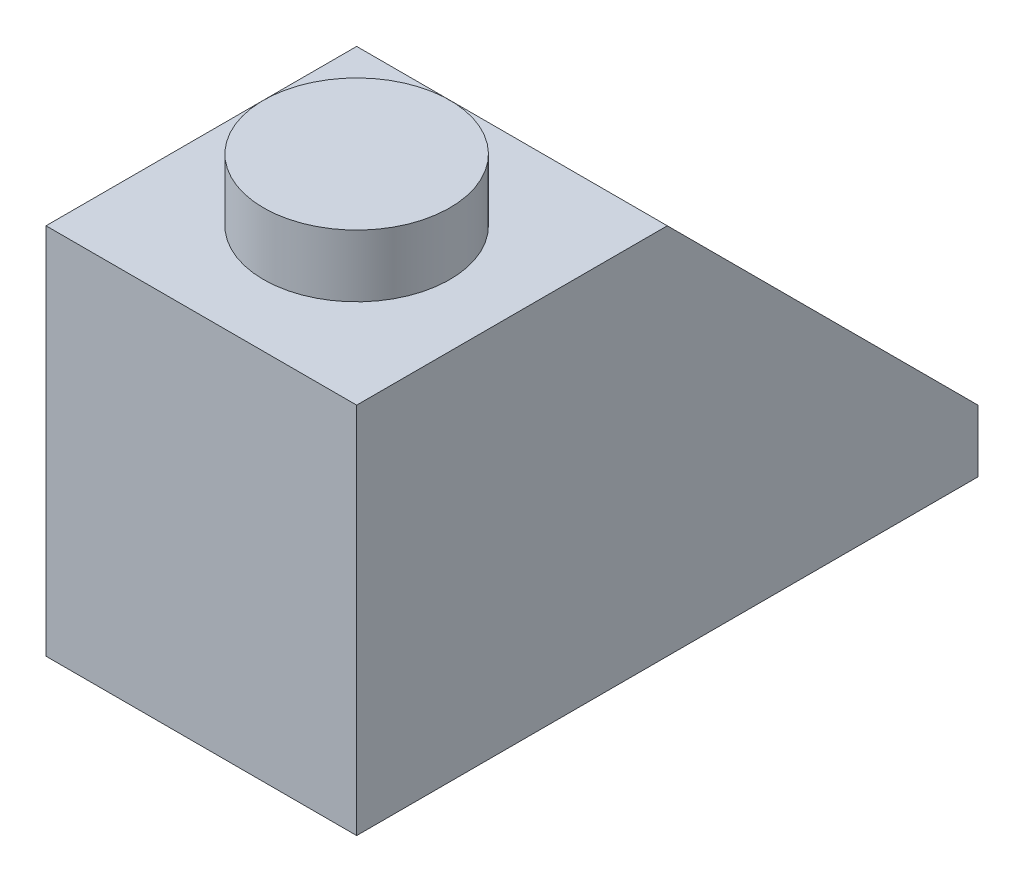
ISO-10303-21;
HEADER;
FILE_DESCRIPTION(('STEP AP214'),'2;1');
FILE_NAME('part.step','',(''),(''),'','','');
FILE_SCHEMA(('AUTOMOTIVE_DESIGN { 1 0 10303 214 1 1 1 1 }'));
ENDSEC;
DATA;
#1=APPLICATION_CONTEXT('core data for automotive mechanical design processes');
#2=APPLICATION_PROTOCOL_DEFINITION('international standard','automotive_design',2000,#1);
#3=PRODUCT_CONTEXT('',#1,'mechanical');
#4=PRODUCT('Part','Part','',(#3));
#5=PRODUCT_RELATED_PRODUCT_CATEGORY('part','',(#4));
#6=PRODUCT_DEFINITION_FORMATION('','',#4);
#7=PRODUCT_DEFINITION_CONTEXT('part definition',#1,'design');
#8=PRODUCT_DEFINITION('design','',#6,#7);
#9=PRODUCT_DEFINITION_SHAPE('','',#8);
#10=(LENGTH_UNIT() NAMED_UNIT(*) SI_UNIT(.MILLI.,.METRE.));
#11=(NAMED_UNIT(*) PLANE_ANGLE_UNIT() SI_UNIT($,.RADIAN.));
#12=(NAMED_UNIT(*) SI_UNIT($,.STERADIAN.) SOLID_ANGLE_UNIT());
#13=UNCERTAINTY_MEASURE_WITH_UNIT(LENGTH_MEASURE(1.E-05),#10,'distance_accuracy_value','');
#14=(GEOMETRIC_REPRESENTATION_CONTEXT(3) GLOBAL_UNCERTAINTY_ASSIGNED_CONTEXT((#13)) GLOBAL_UNIT_ASSIGNED_CONTEXT((#10,
#11,#12)) REPRESENTATION_CONTEXT('',''));
#15=CARTESIAN_POINT('',(0.,0.,0.));
#16=DIRECTION('',(0.,0.,1.));
#17=DIRECTION('',(1.,0.,0.));
#18=AXIS2_PLACEMENT_3D('',#15,#16,#17);
#19=CARTESIAN_POINT('',(5.,0.,0.));
#20=DIRECTION('',(0.,1.,0.));
#21=DIRECTION('',(0.,0.,1.));
#22=AXIS2_PLACEMENT_3D('',#19,#20,#21);
#23=PLANE('',#22);
#24=DIRECTION('',(0.,0.,-1.));
#25=VECTOR('',#24,1.);
#26=CARTESIAN_POINT('',(0.,0.,0.));
#27=LINE('',#26,#25);
#28=CARTESIAN_POINT('',(0.,0.,0.));
#29=VERTEX_POINT('',#28);
#30=CARTESIAN_POINT('',(0.,0.,-10.));
#31=VERTEX_POINT('',#30);
#32=EDGE_CURVE('E159',#29,#31,#27,.T.);
#33=ORIENTED_EDGE('',*,*,#32,.T.);
#34=DIRECTION('',(-1.,0.,0.));
#35=VECTOR('',#34,1.);
#36=CARTESIAN_POINT('',(5.,0.,-10.));
#37=LINE('',#36,#35);
#38=CARTESIAN_POINT('',(5.,0.,-10.));
#39=VERTEX_POINT('',#38);
#40=EDGE_CURVE('E40',#39,#31,#37,.T.);
#41=ORIENTED_EDGE('',*,*,#40,.F.);
#42=DIRECTION('',(0.,0.,-1.));
#43=VECTOR('',#42,1.);
#44=CARTESIAN_POINT('',(5.,0.,0.));
#45=LINE('',#44,#43);
#46=CARTESIAN_POINT('',(5.,0.,0.));
#47=VERTEX_POINT('',#46);
#48=EDGE_CURVE('E179',#47,#39,#45,.T.);
#49=ORIENTED_EDGE('',*,*,#48,.F.);
#50=DIRECTION('',(-1.,0.,0.));
#51=VECTOR('',#50,1.);
#52=CARTESIAN_POINT('',(5.,0.,0.));
#53=LINE('',#52,#51);
#54=EDGE_CURVE('E194',#47,#29,#53,.T.);
#55=ORIENTED_EDGE('',*,*,#54,.T.);
#56=EDGE_LOOP('',(#33,#41,#49,#55));
#57=FACE_BOUND('',#56,.T.);
#58=DIRECTION('',(-1.,0.,0.));
#59=VECTOR('',#58,1.);
#60=CARTESIAN_POINT('',(4.,0.,-1.));
#61=LINE('',#60,#59);
#62=CARTESIAN_POINT('',(4.,0.,-1.));
#63=VERTEX_POINT('',#62);
#64=CARTESIAN_POINT('',(1.,0.,-1.));
#65=VERTEX_POINT('',#64);
#66=EDGE_CURVE('E165',#63,#65,#61,.T.);
#67=ORIENTED_EDGE('',*,*,#66,.F.);
#68=DIRECTION('',(0.,0.,-1.));
#69=VECTOR('',#68,1.);
#70=CARTESIAN_POINT('',(4.,0.,0.));
#71=LINE('',#70,#69);
#72=CARTESIAN_POINT('',(4.,0.,-9.));
#73=VERTEX_POINT('',#72);
#74=EDGE_CURVE('E168',#63,#73,#71,.T.);
#75=ORIENTED_EDGE('',*,*,#74,.T.);
#76=DIRECTION('',(-1.,0.,0.));
#77=VECTOR('',#76,1.);
#78=CARTESIAN_POINT('',(4.,0.,-9.));
#79=LINE('',#78,#77);
#80=CARTESIAN_POINT('',(1.,0.,-9.));
#81=VERTEX_POINT('',#80);
#82=EDGE_CURVE('E172',#73,#81,#79,.T.);
#83=ORIENTED_EDGE('',*,*,#82,.T.);
#84=DIRECTION('',(0.,0.,-1.));
#85=VECTOR('',#84,1.);
#86=CARTESIAN_POINT('',(1.,0.,0.));
#87=LINE('',#86,#85);
#88=EDGE_CURVE('E169',#65,#81,#87,.T.);
#89=ORIENTED_EDGE('',*,*,#88,.F.);
#90=EDGE_LOOP('',(#67,#75,#83,#89));
#91=FACE_BOUND('',#90,.T.);
#92=ADVANCED_FACE('F33',(#57,#91),#23,.F.);
#93=CARTESIAN_POINT('',(0.,0.,0.));
#94=DIRECTION('',(1.,0.,0.));
#95=DIRECTION('',(0.,0.,-1.));
#96=AXIS2_PLACEMENT_3D('',#93,#94,#95);
#97=PLANE('',#96);
#98=DIRECTION('',(0.,1.,0.));
#99=VECTOR('',#98,1.);
#100=CARTESIAN_POINT('',(0.,0.,-10.));
#101=LINE('',#100,#99);
#102=CARTESIAN_POINT('',(0.,1.,-10.));
#103=VERTEX_POINT('',#102);
#104=EDGE_CURVE('E196',#31,#103,#101,.T.);
#105=ORIENTED_EDGE('',*,*,#104,.F.);
#106=ORIENTED_EDGE('',*,*,#32,.F.);
#107=DIRECTION('',(0.,1.,0.));
#108=VECTOR('',#107,1.);
#109=CARTESIAN_POINT('',(0.,0.,0.));
#110=LINE('',#109,#108);
#111=CARTESIAN_POINT('',(0.,6.,0.));
#112=VERTEX_POINT('',#111);
#113=EDGE_CURVE('E183',#29,#112,#110,.T.);
#114=ORIENTED_EDGE('',*,*,#113,.T.);
#115=DIRECTION('',(0.,0.,-1.));
#116=VECTOR('',#115,1.);
#117=CARTESIAN_POINT('',(0.,6.,0.));
#118=LINE('',#117,#116);
#119=CARTESIAN_POINT('',(0.,6.,-5.));
#120=VERTEX_POINT('',#119);
#121=EDGE_CURVE('E202',#112,#120,#118,.T.);
#122=ORIENTED_EDGE('',*,*,#121,.T.);
#123=DIRECTION('',(0.,-0.707106781186548,-0.707106781186548));
#124=VECTOR('',#123,1.);
#125=CARTESIAN_POINT('',(0.,5.5,-5.5));
#126=LINE('',#125,#124);
#127=EDGE_CURVE('E199',#120,#103,#126,.T.);
#128=ORIENTED_EDGE('',*,*,#127,.T.);
#129=EDGE_LOOP('',(#105,#106,#114,#122,#128));
#130=FACE_BOUND('',#129,.T.);
#131=ADVANCED_FACE('F148',(#130),#97,.F.);
#132=CARTESIAN_POINT('',(5.,0.,-10.));
#133=DIRECTION('',(0.,0.,1.));
#134=DIRECTION('',(1.,0.,0.));
#135=AXIS2_PLACEMENT_3D('',#132,#133,#134);
#136=PLANE('',#135);
#137=ORIENTED_EDGE('',*,*,#104,.T.);
#138=DIRECTION('',(-1.,0.,0.));
#139=VECTOR('',#138,1.);
#140=CARTESIAN_POINT('',(5.,1.,-10.));
#141=LINE('',#140,#139);
#142=CARTESIAN_POINT('',(5.,1.,-10.));
#143=VERTEX_POINT('',#142);
#144=EDGE_CURVE('E212',#143,#103,#141,.T.);
#145=ORIENTED_EDGE('',*,*,#144,.F.);
#146=DIRECTION('',(0.,1.,0.));
#147=VECTOR('',#146,1.);
#148=CARTESIAN_POINT('',(5.,0.,-10.));
#149=LINE('',#148,#147);
#150=EDGE_CURVE('E182',#39,#143,#149,.T.);
#151=ORIENTED_EDGE('',*,*,#150,.F.);
#152=ORIENTED_EDGE('',*,*,#40,.T.);
#153=EDGE_LOOP('',(#137,#145,#151,#152));
#154=FACE_BOUND('',#153,.T.);
#155=ADVANCED_FACE('F153',(#154),#136,.F.);
#156=CARTESIAN_POINT('',(5.,5.5,-5.5));
#157=DIRECTION('',(0.,0.707106781186548,-0.707106781186548));
#158=DIRECTION('',(0.,0.707106781186548,0.707106781186548));
#159=AXIS2_PLACEMENT_3D('',#156,#157,#158);
#160=PLANE('',#159);
#161=CARTESIAN_POINT('',(2.5,5.,-6.));
#162=VERTEX_POINT('',#161);
#163=VERTEX_LOOP('',#162);
#164=FACE_BOUND('',#163,.T.);
#165=ORIENTED_EDGE('',*,*,#127,.F.);
#166=DIRECTION('',(-1.,0.,0.));
#167=VECTOR('',#166,1.);
#168=CARTESIAN_POINT('',(5.,6.,-5.));
#169=LINE('',#168,#167);
#170=CARTESIAN_POINT('',(5.,6.,-5.));
#171=VERTEX_POINT('',#170);
#172=EDGE_CURVE('E210',#171,#120,#169,.T.);
#173=ORIENTED_EDGE('',*,*,#172,.F.);
#174=DIRECTION('',(0.,-0.707106781186548,-0.707106781186548));
#175=VECTOR('',#174,1.);
#176=CARTESIAN_POINT('',(5.,5.5,-5.5));
#177=LINE('',#176,#175);
#178=EDGE_CURVE('E185',#171,#143,#177,.T.);
#179=ORIENTED_EDGE('',*,*,#178,.T.);
#180=ORIENTED_EDGE('',*,*,#144,.T.);
#181=EDGE_LOOP('',(#165,#173,#179,#180));
#182=FACE_BOUND('',#181,.T.);
#183=ADVANCED_FACE('F228',(#164,#182),#160,.T.);
#184=CARTESIAN_POINT('',(5.,6.,0.));
#185=DIRECTION('',(0.,1.,0.));
#186=DIRECTION('',(0.,0.,1.));
#187=AXIS2_PLACEMENT_3D('',#184,#185,#186);
#188=PLANE('',#187);
#189=CARTESIAN_POINT('',(2.5,6.,-2.5));
#190=DIRECTION('',(0.,1.,0.));
#191=DIRECTION('',(0.,0.,1.));
#192=AXIS2_PLACEMENT_3D('',#189,#190,#191);
#193=CIRCLE('',#192,1.5);
#194=CARTESIAN_POINT('',(2.5,6.,-1.));
#195=VERTEX_POINT('',#194);
#196=EDGE_CURVE('E128',#195,#195,#193,.T.);
#197=ORIENTED_EDGE('',*,*,#196,.F.);
#198=EDGE_LOOP('',(#197));
#199=FACE_BOUND('',#198,.T.);
#200=ORIENTED_EDGE('',*,*,#121,.F.);
#201=DIRECTION('',(-1.,0.,0.));
#202=VECTOR('',#201,1.);
#203=CARTESIAN_POINT('',(5.,6.,0.));
#204=LINE('',#203,#202);
#205=CARTESIAN_POINT('',(5.,6.,0.));
#206=VERTEX_POINT('',#205);
#207=EDGE_CURVE('E208',#206,#112,#204,.T.);
#208=ORIENTED_EDGE('',*,*,#207,.F.);
#209=DIRECTION('',(0.,0.,-1.));
#210=VECTOR('',#209,1.);
#211=CARTESIAN_POINT('',(5.,6.,0.));
#212=LINE('',#211,#210);
#213=EDGE_CURVE('E188',#206,#171,#212,.T.);
#214=ORIENTED_EDGE('',*,*,#213,.T.);
#215=ORIENTED_EDGE('',*,*,#172,.T.);
#216=EDGE_LOOP('',(#200,#208,#214,#215));
#217=FACE_BOUND('',#216,.T.);
#218=ADVANCED_FACE('F230',(#199,#217),#188,.T.);
#219=CARTESIAN_POINT('',(5.,0.,0.));
#220=DIRECTION('',(0.,0.,1.));
#221=DIRECTION('',(1.,0.,0.));
#222=AXIS2_PLACEMENT_3D('',#219,#220,#221);
#223=PLANE('',#222);
#224=ORIENTED_EDGE('',*,*,#113,.F.);
#225=ORIENTED_EDGE('',*,*,#54,.F.);
#226=DIRECTION('',(0.,1.,0.));
#227=VECTOR('',#226,1.);
#228=CARTESIAN_POINT('',(5.,0.,0.));
#229=LINE('',#228,#227);
#230=EDGE_CURVE('E191',#47,#206,#229,.T.);
#231=ORIENTED_EDGE('',*,*,#230,.T.);
#232=ORIENTED_EDGE('',*,*,#207,.T.);
#233=EDGE_LOOP('',(#224,#225,#231,#232));
#234=FACE_BOUND('',#233,.T.);
#235=ADVANCED_FACE('F224',(#234),#223,.T.);
#236=CARTESIAN_POINT('',(5.,0.,0.));
#237=DIRECTION('',(1.,0.,0.));
#238=DIRECTION('',(0.,0.,-1.));
#239=AXIS2_PLACEMENT_3D('',#236,#237,#238);
#240=PLANE('',#239);
#241=ORIENTED_EDGE('',*,*,#48,.T.);
#242=ORIENTED_EDGE('',*,*,#150,.T.);
#243=ORIENTED_EDGE('',*,*,#178,.F.);
#244=ORIENTED_EDGE('',*,*,#213,.F.);
#245=ORIENTED_EDGE('',*,*,#230,.F.);
#246=EDGE_LOOP('',(#241,#242,#243,#244,#245));
#247=FACE_BOUND('',#246,.T.);
#248=ADVANCED_FACE('F220',(#247),#240,.T.);
#249=CARTESIAN_POINT('',(4.,5.,-5.));
#250=DIRECTION('',(0.,0.707106781186547,-0.707106781186547));
#251=DIRECTION('',(0.,0.707106781186548,0.707106781186548));
#252=AXIS2_PLACEMENT_3D('',#249,#250,#251);
#253=PLANE('',#252);
#254=CARTESIAN_POINT('',(2.5,5.,-5.));
#255=DIRECTION('',(0.,0.707106781186547,-0.707106781186547));
#256=DIRECTION('',(0.,0.707106781186548,0.707106781186548));
#257=AXIS2_PLACEMENT_3D('',#254,#255,#256);
#258=ELLIPSE('',#257,1.4142135623731,1.);
#259=CARTESIAN_POINT('',(1.5,5.,-5.));
#260=VERTEX_POINT('',#259);
#261=CARTESIAN_POINT('',(3.5,5.,-5.));
#262=VERTEX_POINT('',#261);
#263=EDGE_CURVE('E124',#260,#262,#258,.F.);
#264=ORIENTED_EDGE('',*,*,#263,.F.);
#265=DIRECTION('',(-1.,0.,0.));
#266=VECTOR('',#265,1.);
#267=CARTESIAN_POINT('',(4.,5.,-5.));
#268=LINE('',#267,#266);
#269=CARTESIAN_POINT('',(1.,5.,-5.));
#270=VERTEX_POINT('',#269);
#271=EDGE_CURVE('E111',#260,#270,#268,.T.);
#272=ORIENTED_EDGE('',*,*,#271,.T.);
#273=DIRECTION('',(0.,-0.707106781186548,-0.707106781186548));
#274=VECTOR('',#273,1.);
#275=CARTESIAN_POINT('',(1.,5.,-5.));
#276=LINE('',#275,#274);
#277=CARTESIAN_POINT('',(1.,1.,-9.));
#278=VERTEX_POINT('',#277);
#279=EDGE_CURVE('E422',#270,#278,#276,.T.);
#280=ORIENTED_EDGE('',*,*,#279,.T.);
#281=DIRECTION('',(-1.,0.,0.));
#282=VECTOR('',#281,1.);
#283=CARTESIAN_POINT('',(4.,1.,-9.));
#284=LINE('',#283,#282);
#285=CARTESIAN_POINT('',(4.,1.,-9.));
#286=VERTEX_POINT('',#285);
#287=EDGE_CURVE('E175',#286,#278,#284,.T.);
#288=ORIENTED_EDGE('',*,*,#287,.F.);
#289=DIRECTION('',(0.,-0.707106781186548,-0.707106781186548));
#290=VECTOR('',#289,1.);
#291=CARTESIAN_POINT('',(4.,5.,-5.));
#292=LINE('',#291,#290);
#293=CARTESIAN_POINT('',(4.,5.,-5.));
#294=VERTEX_POINT('',#293);
#295=EDGE_CURVE('E409',#294,#286,#292,.T.);
#296=ORIENTED_EDGE('',*,*,#295,.F.);
#297=EDGE_CURVE('E120',#294,#262,#268,.T.);
#298=ORIENTED_EDGE('',*,*,#297,.T.);
#299=EDGE_LOOP('',(#264,#272,#280,#288,#296,#298));
#300=FACE_BOUND('',#299,.T.);
#301=ADVANCED_FACE('F125',(#300),#253,.F.);
#302=CARTESIAN_POINT('',(4.,5.,0.));
#303=DIRECTION('',(0.,1.,0.));
#304=DIRECTION('',(0.,0.,1.));
#305=AXIS2_PLACEMENT_3D('',#302,#303,#304);
#306=PLANE('',#305);
#307=CARTESIAN_POINT('',(2.5,5.,-5.));
#308=DIRECTION('',(0.,1.,0.));
#309=DIRECTION('',(0.,0.,1.));
#310=AXIS2_PLACEMENT_3D('',#307,#308,#309);
#311=CIRCLE('',#310,1.);
#312=EDGE_CURVE('E11',#262,#260,#311,.F.);
#313=ORIENTED_EDGE('',*,*,#312,.F.);
#314=ORIENTED_EDGE('',*,*,#297,.F.);
#315=DIRECTION('',(0.,0.,-1.));
#316=VECTOR('',#315,1.);
#317=CARTESIAN_POINT('',(4.,5.,0.));
#318=LINE('',#317,#316);
#319=CARTESIAN_POINT('',(4.,5.,-0.999999999999999));
#320=VERTEX_POINT('',#319);
#321=EDGE_CURVE('E406',#320,#294,#318,.T.);
#322=ORIENTED_EDGE('',*,*,#321,.F.);
#323=DIRECTION('',(-1.,0.,0.));
#324=VECTOR('',#323,1.);
#325=CARTESIAN_POINT('',(4.,5.,-0.999999999999999));
#326=LINE('',#325,#324);
#327=CARTESIAN_POINT('',(1.,5.,-0.999999999999999));
#328=VERTEX_POINT('',#327);
#329=EDGE_CURVE('E121',#320,#328,#326,.T.);
#330=ORIENTED_EDGE('',*,*,#329,.T.);
#331=DIRECTION('',(0.,0.,-1.));
#332=VECTOR('',#331,1.);
#333=CARTESIAN_POINT('',(1.,5.,0.));
#334=LINE('',#333,#332);
#335=EDGE_CURVE('E116',#328,#270,#334,.T.);
#336=ORIENTED_EDGE('',*,*,#335,.T.);
#337=ORIENTED_EDGE('',*,*,#271,.F.);
#338=EDGE_LOOP('',(#313,#314,#322,#330,#336,#337));
#339=FACE_BOUND('',#338,.T.);
#340=CARTESIAN_POINT('',(2.5,5.,-2.5));
#341=DIRECTION('',(0.,1.,0.));
#342=DIRECTION('',(0.,0.,1.));
#343=AXIS2_PLACEMENT_3D('',#340,#341,#342);
#344=CIRCLE('',#343,0.75);
#345=CARTESIAN_POINT('',(2.5,5.,-1.75));
#346=VERTEX_POINT('',#345);
#347=EDGE_CURVE('E423',#346,#346,#344,.F.);
#348=ORIENTED_EDGE('',*,*,#347,.F.);
#349=EDGE_LOOP('',(#348));
#350=FACE_BOUND('',#349,.T.);
#351=ADVANCED_FACE('F113',(#339,#350),#306,.F.);
#352=CARTESIAN_POINT('',(4.,0.,-1.));
#353=DIRECTION('',(0.,0.,-1.));
#354=DIRECTION('',(0.,1.,0.));
#355=AXIS2_PLACEMENT_3D('',#352,#353,#354);
#356=PLANE('',#355);
#357=DIRECTION('',(0.,-1.,0.));
#358=VECTOR('',#357,1.);
#359=CARTESIAN_POINT('',(1.,0.,-1.));
#360=LINE('',#359,#358);
#361=EDGE_CURVE('E401',#328,#65,#360,.T.);
#362=ORIENTED_EDGE('',*,*,#361,.F.);
#363=ORIENTED_EDGE('',*,*,#329,.F.);
#364=DIRECTION('',(0.,-1.,0.));
#365=VECTOR('',#364,1.);
#366=CARTESIAN_POINT('',(4.,0.,-1.));
#367=LINE('',#366,#365);
#368=EDGE_CURVE('E408',#320,#63,#367,.T.);
#369=ORIENTED_EDGE('',*,*,#368,.T.);
#370=ORIENTED_EDGE('',*,*,#66,.T.);
#371=EDGE_LOOP('',(#362,#363,#369,#370));
#372=FACE_BOUND('',#371,.T.);
#373=ADVANCED_FACE('F274',(#372),#356,.T.);
#374=CARTESIAN_POINT('',(4.,0.,-9.));
#375=DIRECTION('',(0.,0.,1.));
#376=DIRECTION('',(1.,0.,0.));
#377=AXIS2_PLACEMENT_3D('',#374,#375,#376);
#378=PLANE('',#377);
#379=DIRECTION('',(0.,1.,0.));
#380=VECTOR('',#379,1.);
#381=CARTESIAN_POINT('',(1.,0.,-9.));
#382=LINE('',#381,#380);
#383=EDGE_CURVE('E412',#81,#278,#382,.T.);
#384=ORIENTED_EDGE('',*,*,#383,.F.);
#385=ORIENTED_EDGE('',*,*,#82,.F.);
#386=DIRECTION('',(0.,1.,0.));
#387=VECTOR('',#386,1.);
#388=CARTESIAN_POINT('',(4.,0.,-9.));
#389=LINE('',#388,#387);
#390=EDGE_CURVE('E417',#73,#286,#389,.T.);
#391=ORIENTED_EDGE('',*,*,#390,.T.);
#392=ORIENTED_EDGE('',*,*,#287,.T.);
#393=EDGE_LOOP('',(#384,#385,#391,#392));
#394=FACE_BOUND('',#393,.T.);
#395=ADVANCED_FACE('F350',(#394),#378,.T.);
#396=CARTESIAN_POINT('',(4.,0.,0.));
#397=DIRECTION('',(1.,0.,0.));
#398=DIRECTION('',(0.,0.,-1.));
#399=AXIS2_PLACEMENT_3D('',#396,#397,#398);
#400=PLANE('',#399);
#401=ORIENTED_EDGE('',*,*,#295,.T.);
#402=ORIENTED_EDGE('',*,*,#390,.F.);
#403=ORIENTED_EDGE('',*,*,#74,.F.);
#404=ORIENTED_EDGE('',*,*,#368,.F.);
#405=ORIENTED_EDGE('',*,*,#321,.T.);
#406=EDGE_LOOP('',(#401,#402,#403,#404,#405));
#407=FACE_BOUND('',#406,.T.);
#408=ADVANCED_FACE('F325',(#407),#400,.F.);
#409=CARTESIAN_POINT('',(1.,0.,0.));
#410=DIRECTION('',(1.,0.,0.));
#411=DIRECTION('',(0.,0.,-1.));
#412=AXIS2_PLACEMENT_3D('',#409,#410,#411);
#413=PLANE('',#412);
#414=ORIENTED_EDGE('',*,*,#279,.F.);
#415=ORIENTED_EDGE('',*,*,#335,.F.);
#416=ORIENTED_EDGE('',*,*,#361,.T.);
#417=ORIENTED_EDGE('',*,*,#88,.T.);
#418=ORIENTED_EDGE('',*,*,#383,.T.);
#419=EDGE_LOOP('',(#414,#415,#416,#417,#418));
#420=FACE_BOUND('',#419,.T.);
#421=ADVANCED_FACE('F316',(#420),#413,.T.);
#422=CARTESIAN_POINT('',(2.5,-0.00100000000000013,-2.5));
#423=DIRECTION('',(0.,1.,0.));
#424=DIRECTION('',(0.,0.,1.));
#425=AXIS2_PLACEMENT_3D('',#422,#423,#424);
#426=CYLINDRICAL_SURFACE('',#425,0.75);
#427=CARTESIAN_POINT('',(2.5,6.,-2.5));
#428=DIRECTION('',(0.,1.,0.));
#429=DIRECTION('',(0.,0.,1.));
#430=AXIS2_PLACEMENT_3D('',#427,#428,#429);
#431=CIRCLE('',#430,0.75);
#432=CARTESIAN_POINT('',(2.5,6.,-1.75));
#433=VERTEX_POINT('',#432);
#434=EDGE_CURVE('E427',#433,#433,#431,.F.);
#435=CARTESIAN_POINT('',(2.5,6.,-1.75));
#436=CARTESIAN_POINT('',(2.5,5.98958333333333,-1.75));
#437=CARTESIAN_POINT('',(2.5,5.97916666666667,-1.75));
#438=CARTESIAN_POINT('',(2.5,5.95833333333333,-1.75));
#439=CARTESIAN_POINT('',(2.5,5.94791666666667,-1.75));
#440=CARTESIAN_POINT('',(2.5,5.92708333333333,-1.75));
#441=CARTESIAN_POINT('',(2.5,5.91666666666667,-1.75));
#442=CARTESIAN_POINT('',(2.5,5.89583333333333,-1.75));
#443=CARTESIAN_POINT('',(2.5,5.88541666666667,-1.75));
#444=CARTESIAN_POINT('',(2.5,5.86458333333333,-1.75));
#445=CARTESIAN_POINT('',(2.5,5.85416666666667,-1.75));
#446=CARTESIAN_POINT('',(2.5,5.83333333333333,-1.75));
#447=CARTESIAN_POINT('',(2.5,5.82291666666667,-1.75));
#448=CARTESIAN_POINT('',(2.5,5.80208333333333,-1.75));
#449=CARTESIAN_POINT('',(2.5,5.79166666666667,-1.75));
#450=CARTESIAN_POINT('',(2.5,5.77083333333333,-1.75));
#451=CARTESIAN_POINT('',(2.5,5.76041666666667,-1.75));
#452=CARTESIAN_POINT('',(2.5,5.73958333333333,-1.75));
#453=CARTESIAN_POINT('',(2.5,5.72916666666667,-1.75));
#454=CARTESIAN_POINT('',(2.5,5.70833333333333,-1.75));
#455=CARTESIAN_POINT('',(2.5,5.69791666666667,-1.75));
#456=CARTESIAN_POINT('',(2.5,5.67708333333333,-1.75));
#457=CARTESIAN_POINT('',(2.5,5.66666666666667,-1.75));
#458=CARTESIAN_POINT('',(2.5,5.64583333333333,-1.75));
#459=CARTESIAN_POINT('',(2.5,5.63541666666667,-1.75));
#460=CARTESIAN_POINT('',(2.5,5.61458333333333,-1.75));
#461=CARTESIAN_POINT('',(2.5,5.60416666666667,-1.75));
#462=CARTESIAN_POINT('',(2.5,5.58333333333333,-1.75));
#463=CARTESIAN_POINT('',(2.5,5.57291666666667,-1.75));
#464=CARTESIAN_POINT('',(2.5,5.55208333333333,-1.75));
#465=CARTESIAN_POINT('',(2.5,5.54166666666667,-1.75));
#466=CARTESIAN_POINT('',(2.5,5.52083333333333,-1.75));
#467=CARTESIAN_POINT('',(2.5,5.51041666666667,-1.75));
#468=CARTESIAN_POINT('',(2.5,5.48958333333333,-1.75));
#469=CARTESIAN_POINT('',(2.5,5.47916666666667,-1.75));
#470=CARTESIAN_POINT('',(2.5,5.45833333333333,-1.75));
#471=CARTESIAN_POINT('',(2.5,5.44791666666667,-1.75));
#472=CARTESIAN_POINT('',(2.5,5.42708333333333,-1.75));
#473=CARTESIAN_POINT('',(2.5,5.41666666666667,-1.75));
#474=CARTESIAN_POINT('',(2.5,5.39583333333333,-1.75));
#475=CARTESIAN_POINT('',(2.5,5.38541666666667,-1.75));
#476=CARTESIAN_POINT('',(2.5,5.36458333333333,-1.75));
#477=CARTESIAN_POINT('',(2.5,5.35416666666667,-1.75));
#478=CARTESIAN_POINT('',(2.5,5.33333333333333,-1.75));
#479=CARTESIAN_POINT('',(2.5,5.32291666666667,-1.75));
#480=CARTESIAN_POINT('',(2.5,5.30208333333333,-1.75));
#481=CARTESIAN_POINT('',(2.5,5.29166666666667,-1.75));
#482=CARTESIAN_POINT('',(2.5,5.27083333333333,-1.75));
#483=CARTESIAN_POINT('',(2.5,5.26041666666667,-1.75));
#484=CARTESIAN_POINT('',(2.5,5.23958333333333,-1.75));
#485=CARTESIAN_POINT('',(2.5,5.22916666666667,-1.75));
#486=CARTESIAN_POINT('',(2.5,5.20833333333333,-1.75));
#487=CARTESIAN_POINT('',(2.5,5.19791666666667,-1.75));
#488=CARTESIAN_POINT('',(2.5,5.17708333333333,-1.75));
#489=CARTESIAN_POINT('',(2.5,5.16666666666667,-1.75));
#490=CARTESIAN_POINT('',(2.5,5.14583333333333,-1.75));
#491=CARTESIAN_POINT('',(2.5,5.13541666666667,-1.75));
#492=CARTESIAN_POINT('',(2.5,5.11458333333333,-1.75));
#493=CARTESIAN_POINT('',(2.5,5.10416666666667,-1.75));
#494=CARTESIAN_POINT('',(2.5,5.08333333333333,-1.75));
#495=CARTESIAN_POINT('',(2.5,5.07291666666667,-1.75));
#496=CARTESIAN_POINT('',(2.5,5.05208333333333,-1.75));
#497=CARTESIAN_POINT('',(2.5,5.04166666666667,-1.75));
#498=CARTESIAN_POINT('',(2.5,5.02083333333333,-1.75));
#499=CARTESIAN_POINT('',(2.5,5.01041666666667,-1.75));
#500=CARTESIAN_POINT('',(2.5,5.,-1.75));
#501=B_SPLINE_CURVE_WITH_KNOTS('',3,(#435,#436,#437,#438,#439,#440,#441,#442,#443,#444,#445,
#446,#447,#448,#449,#450,#451,#452,#453,#454,#455,#456,#457,#458,#459,#460,#461,#462,#463,#464,
#465,#466,#467,#468,#469,#470,#471,#472,#473,#474,#475,#476,#477,#478,#479,#480,#481,#482,#483,
#484,#485,#486,#487,#488,#489,#490,#491,#492,#493,#494,#495,#496,#497,#498,#499,#500),
.UNSPECIFIED.,.F.,.F.,(4,2,2,2,2,2,2,2,2,2,2,2,2,2,2,2,2,2,2,2,2,2,2,2,2,2,2,2,2,2,2,2,4),(0.,
0.03125,0.0625000000000001,0.0937500000000001,0.125,0.15625,0.1875,0.21875,0.25,0.28125,0.3125,
0.34375,0.375,0.40625,0.4375,0.46875,0.5,0.53125,0.5625,0.593750000000001,0.625000000000001,
0.656250000000001,0.687500000000001,0.718750000000001,0.750000000000001,0.781250000000001,
0.812500000000001,0.843750000000001,0.875000000000001,0.906250000000001,0.937500000000001,
0.968750000000001,1.),.UNSPECIFIED.);
#502=EDGE_CURVE('BSEAM307',#433,#346,#501,.T.);
#503=ORIENTED_EDGE('',*,*,#434,.F.);
#504=ORIENTED_EDGE('',*,*,#347,.T.);
#505=ORIENTED_EDGE('',*,*,#502,.T.);
#506=ORIENTED_EDGE('',*,*,#502,.F.);
#507=EDGE_LOOP('',(#503,#505,#504,#506));
#508=FACE_BOUND('',#507,.T.);
#509=ADVANCED_FACE('F307',(#508),#426,.F.);
#510=CARTESIAN_POINT('',(0.,6.,0.));
#511=DIRECTION('',(0.,1.,0.));
#512=DIRECTION('',(0.,0.,1.));
#513=AXIS2_PLACEMENT_3D('',#510,#511,#512);
#514=PLANE('',#513);
#515=ORIENTED_EDGE('',*,*,#434,.T.);
#516=EDGE_LOOP('',(#515));
#517=FACE_BOUND('',#516,.T.);
#518=ADVANCED_FACE('F298',(#517),#514,.F.);
#519=CARTESIAN_POINT('',(2.5,7.,-2.5));
#520=DIRECTION('',(0.,-1.,0.));
#521=DIRECTION('',(0.,0.,-1.));
#522=AXIS2_PLACEMENT_3D('',#519,#520,#521);
#523=CYLINDRICAL_SURFACE('',#522,1.5);
#524=CARTESIAN_POINT('',(2.5,7.,-2.5));
#525=DIRECTION('',(0.,1.,0.));
#526=DIRECTION('',(0.,0.,1.));
#527=AXIS2_PLACEMENT_3D('',#524,#525,#526);
#528=CIRCLE('',#527,1.5);
#529=CARTESIAN_POINT('',(2.5,7.,-1.));
#530=VERTEX_POINT('',#529);
#531=EDGE_CURVE('E433',#530,#530,#528,.T.);
#532=ORIENTED_EDGE('',*,*,#531,.F.);
#533=EDGE_LOOP('',(#532));
#534=FACE_BOUND('',#533,.T.);
#535=ORIENTED_EDGE('',*,*,#196,.T.);
#536=EDGE_LOOP('',(#535));
#537=FACE_BOUND('',#536,.T.);
#538=ADVANCED_FACE('F143',(#534,#537),#523,.T.);
#539=CARTESIAN_POINT('',(0.,7.,0.));
#540=DIRECTION('',(0.,1.,0.));
#541=DIRECTION('',(0.,0.,1.));
#542=AXIS2_PLACEMENT_3D('',#539,#540,#541);
#543=PLANE('',#542);
#544=ORIENTED_EDGE('',*,*,#531,.T.);
#545=EDGE_LOOP('',(#544));
#546=FACE_BOUND('',#545,.T.);
#547=ADVANCED_FACE('F134',(#546),#543,.T.);
#548=CARTESIAN_POINT('',(2.5,-2.82842712474619,-5.));
#549=DIRECTION('',(0.,1.,0.));
#550=DIRECTION('',(0.,0.,1.));
#551=AXIS2_PLACEMENT_3D('',#548,#549,#550);
#552=CYLINDRICAL_SURFACE('',#551,1.);
#553=CARTESIAN_POINT('',(2.5,0.,-5.));
#554=DIRECTION('',(0.,1.,0.));
#555=DIRECTION('',(0.,0.,1.));
#556=AXIS2_PLACEMENT_3D('',#553,#554,#555);
#557=CIRCLE('',#556,1.);
#558=CARTESIAN_POINT('',(2.5,0.,-4.));
#559=VERTEX_POINT('',#558);
#560=EDGE_CURVE('E129',#559,#559,#557,.T.);
#561=ORIENTED_EDGE('',*,*,#560,.T.);
#562=EDGE_LOOP('',(#561));
#563=FACE_BOUND('',#562,.T.);
#564=ORIENTED_EDGE('',*,*,#312,.T.);
#565=ORIENTED_EDGE('',*,*,#263,.T.);
#566=EDGE_LOOP('',(#564,#565));
#567=FACE_BOUND('',#566,.T.);
#568=ADVANCED_FACE('F131',(#563,#567),#552,.T.);
#569=CARTESIAN_POINT('',(5.,0.,0.));
#570=DIRECTION('',(0.,1.,0.));
#571=DIRECTION('',(0.,0.,1.));
#572=AXIS2_PLACEMENT_3D('',#569,#570,#571);
#573=PLANE('',#572);
#574=ORIENTED_EDGE('',*,*,#560,.F.);
#575=EDGE_LOOP('',(#574));
#576=FACE_BOUND('',#575,.T.);
#577=ADVANCED_FACE('F133',(#576),#573,.F.);
#578=CLOSED_SHELL('',(#92,#131,#155,#183,#218,#235,#248,#301,#351,#373,#395,#408,#421,#509,#518,
#538,#547,#568,#577));
#579=MANIFOLD_SOLID_BREP('B2',#578);
#580=ADVANCED_BREP_SHAPE_REPRESENTATION('',(#18,#579),#14);
#581=SHAPE_DEFINITION_REPRESENTATION(#9,#580);
ENDSEC;
END-ISO-10303-21;
